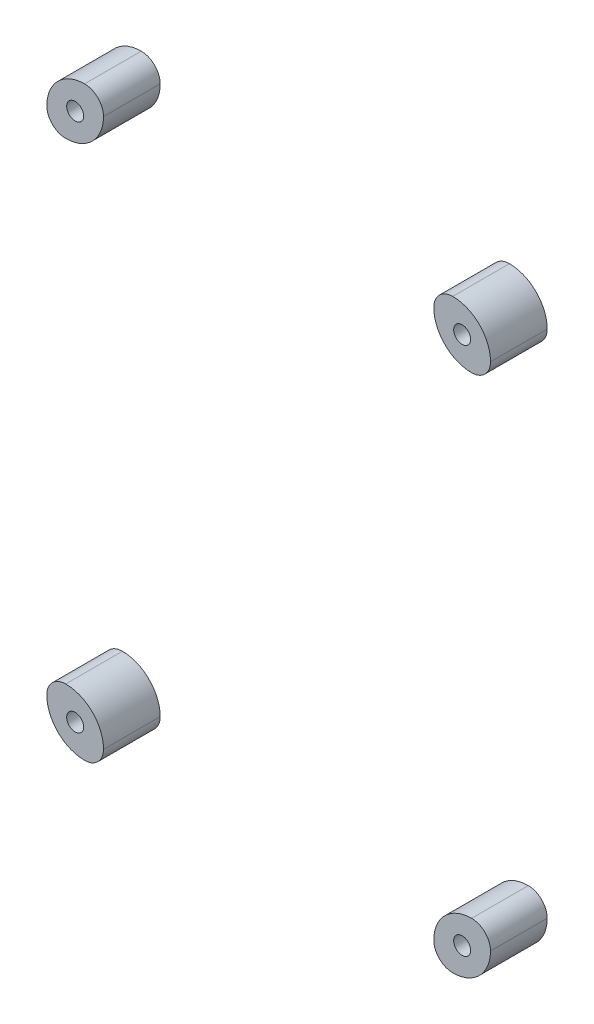
ISO-10303-21;
HEADER;
FILE_DESCRIPTION(('STEP AP214'),'2;1');
FILE_NAME('part.step','',(''),(''),'','','');
FILE_SCHEMA(('AUTOMOTIVE_DESIGN { 1 0 10303 214 1 1 1 1 }'));
ENDSEC;
DATA;
#1=APPLICATION_CONTEXT('core data for automotive mechanical design processes');
#2=APPLICATION_PROTOCOL_DEFINITION('international standard','automotive_design',2000,#1);
#3=PRODUCT_CONTEXT('',#1,'mechanical');
#4=PRODUCT('Part','Part','',(#3));
#5=PRODUCT_RELATED_PRODUCT_CATEGORY('part','',(#4));
#6=PRODUCT_DEFINITION_FORMATION('','',#4);
#7=PRODUCT_DEFINITION_CONTEXT('part definition',#1,'design');
#8=PRODUCT_DEFINITION('design','',#6,#7);
#9=PRODUCT_DEFINITION_SHAPE('','',#8);
#10=(LENGTH_UNIT() NAMED_UNIT(*) SI_UNIT(.MILLI.,.METRE.));
#11=(NAMED_UNIT(*) PLANE_ANGLE_UNIT() SI_UNIT($,.RADIAN.));
#12=(NAMED_UNIT(*) SI_UNIT($,.STERADIAN.) SOLID_ANGLE_UNIT());
#13=UNCERTAINTY_MEASURE_WITH_UNIT(LENGTH_MEASURE(1.E-05),#10,'distance_accuracy_value','');
#14=(GEOMETRIC_REPRESENTATION_CONTEXT(3) GLOBAL_UNCERTAINTY_ASSIGNED_CONTEXT((#13)) GLOBAL_UNIT_ASSIGNED_CONTEXT((#10,
#11,#12)) REPRESENTATION_CONTEXT('',''));
#15=CARTESIAN_POINT('',(0.,0.,0.));
#16=DIRECTION('',(0.,0.,1.));
#17=DIRECTION('',(1.,0.,0.));
#18=AXIS2_PLACEMENT_3D('',#15,#16,#17);
#19=CARTESIAN_POINT('',(-48.6964815263286,-145.,36.2132034355963));
#20=DIRECTION('',(0.,0.,-1.));
#21=DIRECTION('',(1.,0.,0.));
#22=AXIS2_PLACEMENT_3D('',#19,#20,#21);
#23=CYLINDRICAL_SURFACE('',#22,9.99999999999999);
#24=CARTESIAN_POINT('',(-48.6964815263286,-145.,15.));
#25=DIRECTION('',(0.,0.,1.));
#26=DIRECTION('',(-1.,0.,0.));
#27=AXIS2_PLACEMENT_3D('',#24,#25,#26);
#28=CIRCLE('',#27,9.99999999999999);
#29=CARTESIAN_POINT('',(-58.6964815263286,-145.,15.));
#30=VERTEX_POINT('',#29);
#31=CARTESIAN_POINT('',(-48.6964815263286,-155.,15.));
#32=VERTEX_POINT('',#31);
#33=EDGE_CURVE('E111',#30,#32,#28,.T.);
#34=ORIENTED_EDGE('',*,*,#33,.F.);
#35=DIRECTION('',(0.,0.,-1.));
#36=VECTOR('',#35,1.);
#37=CARTESIAN_POINT('',(-58.6964815263286,-145.,36.2132034355963));
#38=LINE('',#37,#36);
#39=CARTESIAN_POINT('',(-58.6964815263286,-145.,0.));
#40=VERTEX_POINT('',#39);
#41=EDGE_CURVE('E54',#30,#40,#38,.T.);
#42=ORIENTED_EDGE('',*,*,#41,.T.);
#43=CARTESIAN_POINT('',(-48.6964815263286,-145.,0.));
#44=DIRECTION('',(0.,0.,1.));
#45=DIRECTION('',(-1.,0.,0.));
#46=AXIS2_PLACEMENT_3D('',#43,#44,#45);
#47=CIRCLE('',#46,9.99999999999999);
#48=CARTESIAN_POINT('',(-48.6964815263286,-155.,0.));
#49=VERTEX_POINT('',#48);
#50=EDGE_CURVE('E106',#40,#49,#47,.T.);
#51=ORIENTED_EDGE('',*,*,#50,.T.);
#52=DIRECTION('',(0.,0.,-1.));
#53=VECTOR('',#52,1.);
#54=CARTESIAN_POINT('',(-48.6964815263286,-155.,36.2132034355963));
#55=LINE('',#54,#53);
#56=EDGE_CURVE('E109',#32,#49,#55,.T.);
#57=ORIENTED_EDGE('',*,*,#56,.F.);
#58=EDGE_LOOP('',(#34,#42,#51,#57));
#59=FACE_BOUND('',#58,.T.);
#60=ADVANCED_FACE('F50',(#59),#23,.T.);
#61=CARTESIAN_POINT('',(-48.6964815263286,-150.,36.2132034355963));
#62=DIRECTION('',(0.,0.,-1.));
#63=DIRECTION('',(1.,0.,0.));
#64=AXIS2_PLACEMENT_3D('',#61,#62,#63);
#65=CYLINDRICAL_SURFACE('',#64,4.99999999999998);
#66=CARTESIAN_POINT('',(-48.6964815263286,-150.,15.));
#67=DIRECTION('',(0.,0.,1.));
#68=DIRECTION('',(-1.,0.,0.));
#69=AXIS2_PLACEMENT_3D('',#66,#67,#68);
#70=CIRCLE('',#69,4.99999999999998);
#71=CARTESIAN_POINT('',(-43.6964815263287,-149.999999999971,15.));
#72=VERTEX_POINT('',#71);
#73=EDGE_CURVE('E59',#32,#72,#70,.T.);
#74=ORIENTED_EDGE('',*,*,#73,.F.);
#75=ORIENTED_EDGE('',*,*,#56,.T.);
#76=CARTESIAN_POINT('',(-48.6964815263286,-150.,0.));
#77=DIRECTION('',(0.,0.,1.));
#78=DIRECTION('',(-1.,0.,0.));
#79=AXIS2_PLACEMENT_3D('',#76,#77,#78);
#80=CIRCLE('',#79,4.99999999999998);
#81=CARTESIAN_POINT('',(-43.6964815263287,-149.999999999971,0.));
#82=VERTEX_POINT('',#81);
#83=EDGE_CURVE('E88',#49,#82,#80,.T.);
#84=ORIENTED_EDGE('',*,*,#83,.T.);
#85=DIRECTION('',(0.,0.,-1.));
#86=VECTOR('',#85,1.);
#87=CARTESIAN_POINT('',(-43.6964815263287,-149.999999999971,36.2132034355963));
#88=LINE('',#87,#86);
#89=EDGE_CURVE('E123',#72,#82,#88,.T.);
#90=ORIENTED_EDGE('',*,*,#89,.F.);
#91=EDGE_LOOP('',(#74,#75,#84,#90));
#92=FACE_BOUND('',#91,.T.);
#93=ADVANCED_FACE('F132',(#92),#65,.T.);
#94=CARTESIAN_POINT('',(-53.6964815263287,-150.,36.2132034355963));
#95=DIRECTION('',(0.,0.,-1.));
#96=DIRECTION('',(1.,0.,0.));
#97=AXIS2_PLACEMENT_3D('',#94,#95,#96);
#98=CYLINDRICAL_SURFACE('',#97,9.99999999999999);
#99=CARTESIAN_POINT('',(-53.6964815263287,-150.,15.));
#100=DIRECTION('',(0.,0.,1.));
#101=DIRECTION('',(-1.,0.,0.));
#102=AXIS2_PLACEMENT_3D('',#99,#100,#101);
#103=CIRCLE('',#102,9.99999999999999);
#104=CARTESIAN_POINT('',(-53.6964815263287,-140.,15.));
#105=VERTEX_POINT('',#104);
#106=EDGE_CURVE('E12',#72,#105,#103,.T.);
#107=ORIENTED_EDGE('',*,*,#106,.F.);
#108=ORIENTED_EDGE('',*,*,#89,.T.);
#109=CARTESIAN_POINT('',(-53.6964815263287,-150.,0.));
#110=DIRECTION('',(0.,0.,1.));
#111=DIRECTION('',(-1.,0.,0.));
#112=AXIS2_PLACEMENT_3D('',#109,#110,#111);
#113=CIRCLE('',#112,9.99999999999999);
#114=CARTESIAN_POINT('',(-53.6964815263287,-140.,0.));
#115=VERTEX_POINT('',#114);
#116=EDGE_CURVE('E121',#82,#115,#113,.T.);
#117=ORIENTED_EDGE('',*,*,#116,.T.);
#118=DIRECTION('',(0.,0.,-1.));
#119=VECTOR('',#118,1.);
#120=CARTESIAN_POINT('',(-53.6964815263287,-140.,36.2132034355963));
#121=LINE('',#120,#119);
#122=EDGE_CURVE('E102',#105,#115,#121,.T.);
#123=ORIENTED_EDGE('',*,*,#122,.F.);
#124=EDGE_LOOP('',(#107,#108,#117,#123));
#125=FACE_BOUND('',#124,.T.);
#126=ADVANCED_FACE('F131',(#125),#98,.T.);
#127=CARTESIAN_POINT('',(-53.6964815263287,-145.,36.2132034355963));
#128=DIRECTION('',(0.,0.,-1.));
#129=DIRECTION('',(1.,0.,0.));
#130=AXIS2_PLACEMENT_3D('',#127,#128,#129);
#131=CYLINDRICAL_SURFACE('',#130,4.99999999999998);
#132=CARTESIAN_POINT('',(-53.6964815263287,-145.,15.));
#133=DIRECTION('',(0.,0.,1.));
#134=DIRECTION('',(-1.,0.,0.));
#135=AXIS2_PLACEMENT_3D('',#132,#133,#134);
#136=CIRCLE('',#135,4.99999999999998);
#137=EDGE_CURVE('E66',#105,#30,#136,.T.);
#138=ORIENTED_EDGE('',*,*,#137,.F.);
#139=ORIENTED_EDGE('',*,*,#122,.T.);
#140=CARTESIAN_POINT('',(-53.6964815263287,-145.,0.));
#141=DIRECTION('',(0.,0.,1.));
#142=DIRECTION('',(-1.,0.,0.));
#143=AXIS2_PLACEMENT_3D('',#140,#141,#142);
#144=CIRCLE('',#143,4.99999999999998);
#145=EDGE_CURVE('E75',#115,#40,#144,.T.);
#146=ORIENTED_EDGE('',*,*,#145,.T.);
#147=ORIENTED_EDGE('',*,*,#41,.F.);
#148=EDGE_LOOP('',(#138,#139,#146,#147));
#149=FACE_BOUND('',#148,.T.);
#150=ADVANCED_FACE('F98',(#149),#131,.T.);
#151=CARTESIAN_POINT('',(-48.6964815263286,-147.5,0.));
#152=DIRECTION('',(0.,0.,1.));
#153=DIRECTION('',(-1.,0.,0.));
#154=AXIS2_PLACEMENT_3D('',#151,#152,#153);
#155=PLANE('',#154);
#156=CARTESIAN_POINT('',(-51.1964815263287,-147.5,0.));
#157=DIRECTION('',(0.,0.,1.));
#158=DIRECTION('',(-1.,0.,0.));
#159=AXIS2_PLACEMENT_3D('',#156,#157,#158);
#160=CIRCLE('',#159,2.25);
#161=CARTESIAN_POINT('',(-53.4464815263287,-147.5,0.));
#162=VERTEX_POINT('',#161);
#163=EDGE_CURVE('E112',#162,#162,#160,.T.);
#164=ORIENTED_EDGE('',*,*,#163,.T.);
#165=EDGE_LOOP('',(#164));
#166=FACE_BOUND('',#165,.T.);
#167=ORIENTED_EDGE('',*,*,#50,.F.);
#168=ORIENTED_EDGE('',*,*,#145,.F.);
#169=ORIENTED_EDGE('',*,*,#116,.F.);
#170=ORIENTED_EDGE('',*,*,#83,.F.);
#171=EDGE_LOOP('',(#167,#168,#169,#170));
#172=FACE_BOUND('',#171,.T.);
#173=ADVANCED_FACE('F107',(#166,#172),#155,.F.);
#174=CARTESIAN_POINT('',(48.6964815263286,-145.,15.));
#175=DIRECTION('',(0.,0.,1.));
#176=DIRECTION('',(-1.,0.,0.));
#177=AXIS2_PLACEMENT_3D('',#174,#175,#176);
#178=PLANE('',#177);
#179=CARTESIAN_POINT('',(-51.1964815263287,-147.5,15.));
#180=DIRECTION('',(0.,0.,1.));
#181=DIRECTION('',(-1.,0.,0.));
#182=AXIS2_PLACEMENT_3D('',#179,#180,#181);
#183=CIRCLE('',#182,2.24999999999999);
#184=CARTESIAN_POINT('',(-53.4464815263286,-147.5,15.));
#185=VERTEX_POINT('',#184);
#186=EDGE_CURVE('E114',#185,#185,#183,.T.);
#187=ORIENTED_EDGE('',*,*,#186,.F.);
#188=EDGE_LOOP('',(#187));
#189=FACE_BOUND('',#188,.T.);
#190=ORIENTED_EDGE('',*,*,#137,.T.);
#191=ORIENTED_EDGE('',*,*,#33,.T.);
#192=ORIENTED_EDGE('',*,*,#73,.T.);
#193=ORIENTED_EDGE('',*,*,#106,.T.);
#194=EDGE_LOOP('',(#190,#191,#192,#193));
#195=FACE_BOUND('',#194,.T.);
#196=ADVANCED_FACE('F52',(#189,#195),#178,.T.);
#197=CARTESIAN_POINT('',(-51.1964815263287,-147.5,15.));
#198=DIRECTION('',(0.,0.,1.));
#199=DIRECTION('',(-1.,0.,0.));
#200=AXIS2_PLACEMENT_3D('',#197,#198,#199);
#201=CYLINDRICAL_SURFACE('',#200,2.24999999999999);
#202=ORIENTED_EDGE('',*,*,#163,.F.);
#203=EDGE_LOOP('',(#202));
#204=FACE_BOUND('',#203,.T.);
#205=ORIENTED_EDGE('',*,*,#186,.T.);
#206=EDGE_LOOP('',(#205));
#207=FACE_BOUND('',#206,.T.);
#208=ADVANCED_FACE('F134',(#204,#207),#201,.F.);
#209=CLOSED_SHELL('',(#60,#93,#126,#150,#173,#196,#208));
#210=MANIFOLD_SOLID_BREP('B2',#209);
#211=CARTESIAN_POINT('',(-48.6964815263286,-9.99999999999999,36.2132034355963));
#212=DIRECTION('',(0.,0.,-1.));
#213=DIRECTION('',(1.,0.,0.));
#214=AXIS2_PLACEMENT_3D('',#211,#212,#213);
#215=CYLINDRICAL_SURFACE('',#214,9.99999999999999);
#216=CARTESIAN_POINT('',(-48.6964815263286,-9.99999999999999,15.));
#217=DIRECTION('',(0.,0.,-1.));
#218=DIRECTION('',(-1.,0.,0.));
#219=AXIS2_PLACEMENT_3D('',#216,#217,#218);
#220=CIRCLE('',#219,9.99999999999999);
#221=CARTESIAN_POINT('',(-58.6964815263286,-9.99999999999992,15.));
#222=VERTEX_POINT('',#221);
#223=CARTESIAN_POINT('',(-48.6964815263286,0.,15.));
#224=VERTEX_POINT('',#223);
#225=EDGE_CURVE('E287',#222,#224,#220,.T.);
#226=ORIENTED_EDGE('',*,*,#225,.T.);
#227=DIRECTION('',(0.,0.,-1.));
#228=VECTOR('',#227,1.);
#229=CARTESIAN_POINT('',(-48.6964815263286,0.,36.2132034355963));
#230=LINE('',#229,#228);
#231=CARTESIAN_POINT('',(-48.6964815263286,0.,0.));
#232=VERTEX_POINT('',#231);
#233=EDGE_CURVE('E280',#224,#232,#230,.T.);
#234=ORIENTED_EDGE('',*,*,#233,.T.);
#235=CARTESIAN_POINT('',(-48.6964815263286,-9.99999999999999,0.));
#236=DIRECTION('',(0.,0.,-1.));
#237=DIRECTION('',(-1.,0.,0.));
#238=AXIS2_PLACEMENT_3D('',#235,#236,#237);
#239=CIRCLE('',#238,9.99999999999999);
#240=CARTESIAN_POINT('',(-58.6964815263286,-9.99999999999992,0.));
#241=VERTEX_POINT('',#240);
#242=EDGE_CURVE('E270',#241,#232,#239,.T.);
#243=ORIENTED_EDGE('',*,*,#242,.F.);
#244=DIRECTION('',(0.,0.,-1.));
#245=VECTOR('',#244,1.);
#246=CARTESIAN_POINT('',(-58.6964815263286,-9.99999999999992,36.2132034355963));
#247=LINE('',#246,#245);
#248=EDGE_CURVE('E223',#222,#241,#247,.T.);
#249=ORIENTED_EDGE('',*,*,#248,.F.);
#250=EDGE_LOOP('',(#226,#234,#243,#249));
#251=FACE_BOUND('',#250,.T.);
#252=ADVANCED_FACE('F219',(#251),#215,.T.);
#253=CARTESIAN_POINT('',(-48.6964815263286,-4.99999999999999,36.2132034355963));
#254=DIRECTION('',(0.,0.,-1.));
#255=DIRECTION('',(1.,0.,0.));
#256=AXIS2_PLACEMENT_3D('',#253,#254,#255);
#257=CYLINDRICAL_SURFACE('',#256,4.99999999999998);
#258=CARTESIAN_POINT('',(-48.6964815263286,-4.99999999999999,15.));
#259=DIRECTION('',(0.,0.,-1.));
#260=DIRECTION('',(-1.,0.,0.));
#261=AXIS2_PLACEMENT_3D('',#258,#259,#260);
#262=CIRCLE('',#261,4.99999999999998);
#263=CARTESIAN_POINT('',(-43.6964815263287,-5.00000000002915,15.));
#264=VERTEX_POINT('',#263);
#265=EDGE_CURVE('E228',#224,#264,#262,.T.);
#266=ORIENTED_EDGE('',*,*,#265,.T.);
#267=DIRECTION('',(0.,0.,-1.));
#268=VECTOR('',#267,1.);
#269=CARTESIAN_POINT('',(-43.6964815263287,-5.00000000002915,36.2132034355963));
#270=LINE('',#269,#268);
#271=CARTESIAN_POINT('',(-43.6964815263287,-5.00000000002915,0.));
#272=VERTEX_POINT('',#271);
#273=EDGE_CURVE('E290',#264,#272,#270,.T.);
#274=ORIENTED_EDGE('',*,*,#273,.T.);
#275=CARTESIAN_POINT('',(-48.6964815263286,-4.99999999999999,0.));
#276=DIRECTION('',(0.,0.,-1.));
#277=DIRECTION('',(-1.,0.,0.));
#278=AXIS2_PLACEMENT_3D('',#275,#276,#277);
#279=CIRCLE('',#278,4.99999999999998);
#280=EDGE_CURVE('E259',#232,#272,#279,.T.);
#281=ORIENTED_EDGE('',*,*,#280,.F.);
#282=ORIENTED_EDGE('',*,*,#233,.F.);
#283=EDGE_LOOP('',(#266,#274,#281,#282));
#284=FACE_BOUND('',#283,.T.);
#285=ADVANCED_FACE('F309',(#284),#257,.T.);
#286=CARTESIAN_POINT('',(-53.6964815263287,-4.99999999999991,36.2132034355963));
#287=DIRECTION('',(0.,0.,-1.));
#288=DIRECTION('',(1.,0.,0.));
#289=AXIS2_PLACEMENT_3D('',#286,#287,#288);
#290=CYLINDRICAL_SURFACE('',#289,9.99999999999999);
#291=CARTESIAN_POINT('',(-53.6964815263287,-4.99999999999991,15.));
#292=DIRECTION('',(0.,0.,-1.));
#293=DIRECTION('',(-1.,0.,0.));
#294=AXIS2_PLACEMENT_3D('',#291,#292,#293);
#295=CIRCLE('',#294,9.99999999999999);
#296=CARTESIAN_POINT('',(-53.6964815263287,-14.9999999999999,15.));
#297=VERTEX_POINT('',#296);
#298=EDGE_CURVE('E48',#264,#297,#295,.T.);
#299=ORIENTED_EDGE('',*,*,#298,.T.);
#300=DIRECTION('',(0.,0.,-1.));
#301=VECTOR('',#300,1.);
#302=CARTESIAN_POINT('',(-53.6964815263287,-14.9999999999999,36.2132034355963));
#303=LINE('',#302,#301);
#304=CARTESIAN_POINT('',(-53.6964815263287,-14.9999999999999,0.));
#305=VERTEX_POINT('',#304);
#306=EDGE_CURVE('E274',#297,#305,#303,.T.);
#307=ORIENTED_EDGE('',*,*,#306,.T.);
#308=CARTESIAN_POINT('',(-53.6964815263287,-4.99999999999991,0.));
#309=DIRECTION('',(0.,0.,-1.));
#310=DIRECTION('',(-1.,0.,0.));
#311=AXIS2_PLACEMENT_3D('',#308,#309,#310);
#312=CIRCLE('',#311,9.99999999999999);
#313=EDGE_CURVE('E272',#272,#305,#312,.T.);
#314=ORIENTED_EDGE('',*,*,#313,.F.);
#315=ORIENTED_EDGE('',*,*,#273,.F.);
#316=EDGE_LOOP('',(#299,#307,#314,#315));
#317=FACE_BOUND('',#316,.T.);
#318=ADVANCED_FACE('F313',(#317),#290,.T.);
#319=CARTESIAN_POINT('',(-53.6964815263287,-9.99999999999993,36.2132034355963));
#320=DIRECTION('',(0.,0.,-1.));
#321=DIRECTION('',(1.,0.,0.));
#322=AXIS2_PLACEMENT_3D('',#319,#320,#321);
#323=CYLINDRICAL_SURFACE('',#322,4.99999999999998);
#324=CARTESIAN_POINT('',(-53.6964815263287,-9.99999999999993,15.));
#325=DIRECTION('',(0.,0.,-1.));
#326=DIRECTION('',(-1.,0.,0.));
#327=AXIS2_PLACEMENT_3D('',#324,#325,#326);
#328=CIRCLE('',#327,4.99999999999998);
#329=EDGE_CURVE('E236',#297,#222,#328,.T.);
#330=ORIENTED_EDGE('',*,*,#329,.T.);
#331=ORIENTED_EDGE('',*,*,#248,.T.);
#332=CARTESIAN_POINT('',(-53.6964815263287,-9.99999999999993,0.));
#333=DIRECTION('',(0.,0.,-1.));
#334=DIRECTION('',(-1.,0.,0.));
#335=AXIS2_PLACEMENT_3D('',#332,#333,#334);
#336=CIRCLE('',#335,4.99999999999998);
#337=EDGE_CURVE('E242',#305,#241,#336,.T.);
#338=ORIENTED_EDGE('',*,*,#337,.F.);
#339=ORIENTED_EDGE('',*,*,#306,.F.);
#340=EDGE_LOOP('',(#330,#331,#338,#339));
#341=FACE_BOUND('',#340,.T.);
#342=ADVANCED_FACE('F276',(#341),#323,.T.);
#343=CARTESIAN_POINT('',(-48.6964815263286,-7.49999999999999,0.));
#344=DIRECTION('',(0.,0.,1.));
#345=DIRECTION('',(-1.,0.,0.));
#346=AXIS2_PLACEMENT_3D('',#343,#344,#345);
#347=PLANE('',#346);
#348=CARTESIAN_POINT('',(-51.1964815263287,-7.49999999999995,0.));
#349=DIRECTION('',(0.,0.,-1.));
#350=DIRECTION('',(-1.,0.,0.));
#351=AXIS2_PLACEMENT_3D('',#348,#349,#350);
#352=CIRCLE('',#351,2.25);
#353=CARTESIAN_POINT('',(-53.4464815263287,-7.49999999999995,0.));
#354=VERTEX_POINT('',#353);
#355=EDGE_CURVE('E279',#354,#354,#352,.T.);
#356=ORIENTED_EDGE('',*,*,#355,.F.);
#357=EDGE_LOOP('',(#356));
#358=FACE_BOUND('',#357,.T.);
#359=ORIENTED_EDGE('',*,*,#242,.T.);
#360=ORIENTED_EDGE('',*,*,#280,.T.);
#361=ORIENTED_EDGE('',*,*,#313,.T.);
#362=ORIENTED_EDGE('',*,*,#337,.T.);
#363=EDGE_LOOP('',(#359,#360,#361,#362));
#364=FACE_BOUND('',#363,.T.);
#365=ADVANCED_FACE('F268',(#358,#364),#347,.F.);
#366=CARTESIAN_POINT('',(48.6964815263286,-10.,15.));
#367=DIRECTION('',(0.,0.,1.));
#368=DIRECTION('',(-1.,0.,0.));
#369=AXIS2_PLACEMENT_3D('',#366,#367,#368);
#370=PLANE('',#369);
#371=CARTESIAN_POINT('',(-51.1964815263287,-7.49999999999995,15.));
#372=DIRECTION('',(0.,0.,-1.));
#373=DIRECTION('',(-1.,0.,0.));
#374=AXIS2_PLACEMENT_3D('',#371,#372,#373);
#375=CIRCLE('',#374,2.24999999999999);
#376=CARTESIAN_POINT('',(-53.4464815263286,-7.49999999999995,15.));
#377=VERTEX_POINT('',#376);
#378=EDGE_CURVE('E295',#377,#377,#375,.T.);
#379=ORIENTED_EDGE('',*,*,#378,.T.);
#380=EDGE_LOOP('',(#379));
#381=FACE_BOUND('',#380,.T.);
#382=ORIENTED_EDGE('',*,*,#329,.F.);
#383=ORIENTED_EDGE('',*,*,#298,.F.);
#384=ORIENTED_EDGE('',*,*,#265,.F.);
#385=ORIENTED_EDGE('',*,*,#225,.F.);
#386=EDGE_LOOP('',(#382,#383,#384,#385));
#387=FACE_BOUND('',#386,.T.);
#388=ADVANCED_FACE('F221',(#381,#387),#370,.T.);
#389=CARTESIAN_POINT('',(-51.1964815263287,-7.49999999999995,15.));
#390=DIRECTION('',(0.,0.,1.));
#391=DIRECTION('',(-1.,0.,0.));
#392=AXIS2_PLACEMENT_3D('',#389,#390,#391);
#393=CYLINDRICAL_SURFACE('',#392,2.24999999999999);
#394=ORIENTED_EDGE('',*,*,#355,.T.);
#395=EDGE_LOOP('',(#394));
#396=FACE_BOUND('',#395,.T.);
#397=ORIENTED_EDGE('',*,*,#378,.F.);
#398=EDGE_LOOP('',(#397));
#399=FACE_BOUND('',#398,.T.);
#400=ADVANCED_FACE('F300',(#396,#399),#393,.F.);
#401=CLOSED_SHELL('',(#252,#285,#318,#342,#365,#388,#400));
#402=MANIFOLD_SOLID_BREP('B6',#401);
#403=CARTESIAN_POINT('',(48.6964815263286,-145.,36.2132034355963));
#404=DIRECTION('',(0.,0.,-1.));
#405=DIRECTION('',(-1.,0.,0.));
#406=AXIS2_PLACEMENT_3D('',#403,#404,#405);
#407=CYLINDRICAL_SURFACE('',#406,9.99999999999999);
#408=CARTESIAN_POINT('',(48.6964815263286,-145.,15.));
#409=DIRECTION('',(0.,0.,-1.));
#410=DIRECTION('',(1.,0.,0.));
#411=AXIS2_PLACEMENT_3D('',#408,#409,#410);
#412=CIRCLE('',#411,9.99999999999999);
#413=CARTESIAN_POINT('',(58.6964815263286,-145.,15.));
#414=VERTEX_POINT('',#413);
#415=CARTESIAN_POINT('',(48.6964815263286,-155.,15.));
#416=VERTEX_POINT('',#415);
#417=EDGE_CURVE('E455',#414,#416,#412,.T.);
#418=ORIENTED_EDGE('',*,*,#417,.T.);
#419=DIRECTION('',(0.,0.,-1.));
#420=VECTOR('',#419,1.);
#421=CARTESIAN_POINT('',(48.6964815263286,-155.,36.2132034355963));
#422=LINE('',#421,#420);
#423=CARTESIAN_POINT('',(48.6964815263286,-155.,0.));
#424=VERTEX_POINT('',#423);
#425=EDGE_CURVE('E448',#416,#424,#422,.T.);
#426=ORIENTED_EDGE('',*,*,#425,.T.);
#427=CARTESIAN_POINT('',(48.6964815263286,-145.,0.));
#428=DIRECTION('',(0.,0.,-1.));
#429=DIRECTION('',(1.,0.,0.));
#430=AXIS2_PLACEMENT_3D('',#427,#428,#429);
#431=CIRCLE('',#430,9.99999999999999);
#432=CARTESIAN_POINT('',(58.6964815263286,-145.,0.));
#433=VERTEX_POINT('',#432);
#434=EDGE_CURVE('E438',#433,#424,#431,.T.);
#435=ORIENTED_EDGE('',*,*,#434,.F.);
#436=DIRECTION('',(0.,0.,-1.));
#437=VECTOR('',#436,1.);
#438=CARTESIAN_POINT('',(58.6964815263286,-145.,36.2132034355963));
#439=LINE('',#438,#437);
#440=EDGE_CURVE('E391',#414,#433,#439,.T.);
#441=ORIENTED_EDGE('',*,*,#440,.F.);
#442=EDGE_LOOP('',(#418,#426,#435,#441));
#443=FACE_BOUND('',#442,.T.);
#444=ADVANCED_FACE('F387',(#443),#407,.T.);
#445=CARTESIAN_POINT('',(48.6964815263286,-150.,36.2132034355963));
#446=DIRECTION('',(0.,0.,-1.));
#447=DIRECTION('',(-1.,0.,0.));
#448=AXIS2_PLACEMENT_3D('',#445,#446,#447);
#449=CYLINDRICAL_SURFACE('',#448,4.99999999999998);
#450=CARTESIAN_POINT('',(48.6964815263286,-150.,15.));
#451=DIRECTION('',(0.,0.,-1.));
#452=DIRECTION('',(1.,0.,0.));
#453=AXIS2_PLACEMENT_3D('',#450,#451,#452);
#454=CIRCLE('',#453,4.99999999999998);
#455=CARTESIAN_POINT('',(43.6964815263287,-149.999999999971,15.));
#456=VERTEX_POINT('',#455);
#457=EDGE_CURVE('E396',#416,#456,#454,.T.);
#458=ORIENTED_EDGE('',*,*,#457,.T.);
#459=DIRECTION('',(0.,0.,-1.));
#460=VECTOR('',#459,1.);
#461=CARTESIAN_POINT('',(43.6964815263287,-149.999999999971,36.2132034355963));
#462=LINE('',#461,#460);
#463=CARTESIAN_POINT('',(43.6964815263287,-149.999999999971,0.));
#464=VERTEX_POINT('',#463);
#465=EDGE_CURVE('E458',#456,#464,#462,.T.);
#466=ORIENTED_EDGE('',*,*,#465,.T.);
#467=CARTESIAN_POINT('',(48.6964815263286,-150.,0.));
#468=DIRECTION('',(0.,0.,-1.));
#469=DIRECTION('',(1.,0.,0.));
#470=AXIS2_PLACEMENT_3D('',#467,#468,#469);
#471=CIRCLE('',#470,4.99999999999998);
#472=EDGE_CURVE('E427',#424,#464,#471,.T.);
#473=ORIENTED_EDGE('',*,*,#472,.F.);
#474=ORIENTED_EDGE('',*,*,#425,.F.);
#475=EDGE_LOOP('',(#458,#466,#473,#474));
#476=FACE_BOUND('',#475,.T.);
#477=ADVANCED_FACE('F477',(#476),#449,.T.);
#478=CARTESIAN_POINT('',(53.6964815263287,-150.,36.2132034355963));
#479=DIRECTION('',(0.,0.,-1.));
#480=DIRECTION('',(-1.,0.,0.));
#481=AXIS2_PLACEMENT_3D('',#478,#479,#480);
#482=CYLINDRICAL_SURFACE('',#481,9.99999999999999);
#483=CARTESIAN_POINT('',(53.6964815263287,-150.,15.));
#484=DIRECTION('',(0.,0.,-1.));
#485=DIRECTION('',(1.,0.,0.));
#486=AXIS2_PLACEMENT_3D('',#483,#484,#485);
#487=CIRCLE('',#486,9.99999999999999);
#488=CARTESIAN_POINT('',(53.6964815263287,-140.,15.));
#489=VERTEX_POINT('',#488);
#490=EDGE_CURVE('E217',#456,#489,#487,.T.);
#491=ORIENTED_EDGE('',*,*,#490,.T.);
#492=DIRECTION('',(0.,0.,-1.));
#493=VECTOR('',#492,1.);
#494=CARTESIAN_POINT('',(53.6964815263287,-140.,36.2132034355963));
#495=LINE('',#494,#493);
#496=CARTESIAN_POINT('',(53.6964815263287,-140.,0.));
#497=VERTEX_POINT('',#496);
#498=EDGE_CURVE('E442',#489,#497,#495,.T.);
#499=ORIENTED_EDGE('',*,*,#498,.T.);
#500=CARTESIAN_POINT('',(53.6964815263287,-150.,0.));
#501=DIRECTION('',(0.,0.,-1.));
#502=DIRECTION('',(1.,0.,0.));
#503=AXIS2_PLACEMENT_3D('',#500,#501,#502);
#504=CIRCLE('',#503,9.99999999999999);
#505=EDGE_CURVE('E440',#464,#497,#504,.T.);
#506=ORIENTED_EDGE('',*,*,#505,.F.);
#507=ORIENTED_EDGE('',*,*,#465,.F.);
#508=EDGE_LOOP('',(#491,#499,#506,#507));
#509=FACE_BOUND('',#508,.T.);
#510=ADVANCED_FACE('F481',(#509),#482,.T.);
#511=CARTESIAN_POINT('',(53.6964815263287,-145.,36.2132034355963));
#512=DIRECTION('',(0.,0.,-1.));
#513=DIRECTION('',(-1.,0.,0.));
#514=AXIS2_PLACEMENT_3D('',#511,#512,#513);
#515=CYLINDRICAL_SURFACE('',#514,4.99999999999998);
#516=CARTESIAN_POINT('',(53.6964815263287,-145.,15.));
#517=DIRECTION('',(0.,0.,-1.));
#518=DIRECTION('',(1.,0.,0.));
#519=AXIS2_PLACEMENT_3D('',#516,#517,#518);
#520=CIRCLE('',#519,4.99999999999998);
#521=EDGE_CURVE('E404',#489,#414,#520,.T.);
#522=ORIENTED_EDGE('',*,*,#521,.T.);
#523=ORIENTED_EDGE('',*,*,#440,.T.);
#524=CARTESIAN_POINT('',(53.6964815263287,-145.,0.));
#525=DIRECTION('',(0.,0.,-1.));
#526=DIRECTION('',(1.,0.,0.));
#527=AXIS2_PLACEMENT_3D('',#524,#525,#526);
#528=CIRCLE('',#527,4.99999999999998);
#529=EDGE_CURVE('E410',#497,#433,#528,.T.);
#530=ORIENTED_EDGE('',*,*,#529,.F.);
#531=ORIENTED_EDGE('',*,*,#498,.F.);
#532=EDGE_LOOP('',(#522,#523,#530,#531));
#533=FACE_BOUND('',#532,.T.);
#534=ADVANCED_FACE('F444',(#533),#515,.T.);
#535=CARTESIAN_POINT('',(48.6964815263286,-147.5,0.));
#536=DIRECTION('',(0.,0.,1.));
#537=DIRECTION('',(1.,0.,0.));
#538=AXIS2_PLACEMENT_3D('',#535,#536,#537);
#539=PLANE('',#538);
#540=CARTESIAN_POINT('',(51.1964815263287,-147.5,0.));
#541=DIRECTION('',(0.,0.,-1.));
#542=DIRECTION('',(1.,0.,0.));
#543=AXIS2_PLACEMENT_3D('',#540,#541,#542);
#544=CIRCLE('',#543,2.25);
#545=CARTESIAN_POINT('',(53.4464815263287,-147.5,0.));
#546=VERTEX_POINT('',#545);
#547=EDGE_CURVE('E447',#546,#546,#544,.T.);
#548=ORIENTED_EDGE('',*,*,#547,.F.);
#549=EDGE_LOOP('',(#548));
#550=FACE_BOUND('',#549,.T.);
#551=ORIENTED_EDGE('',*,*,#434,.T.);
#552=ORIENTED_EDGE('',*,*,#472,.T.);
#553=ORIENTED_EDGE('',*,*,#505,.T.);
#554=ORIENTED_EDGE('',*,*,#529,.T.);
#555=EDGE_LOOP('',(#551,#552,#553,#554));
#556=FACE_BOUND('',#555,.T.);
#557=ADVANCED_FACE('F436',(#550,#556),#539,.F.);
#558=CARTESIAN_POINT('',(-48.6964815263286,-145.,15.));
#559=DIRECTION('',(0.,0.,1.));
#560=DIRECTION('',(1.,0.,0.));
#561=AXIS2_PLACEMENT_3D('',#558,#559,#560);
#562=PLANE('',#561);
#563=CARTESIAN_POINT('',(51.1964815263287,-147.5,15.));
#564=DIRECTION('',(0.,0.,-1.));
#565=DIRECTION('',(1.,0.,0.));
#566=AXIS2_PLACEMENT_3D('',#563,#564,#565);
#567=CIRCLE('',#566,2.24999999999999);
#568=CARTESIAN_POINT('',(53.4464815263286,-147.5,15.));
#569=VERTEX_POINT('',#568);
#570=EDGE_CURVE('E463',#569,#569,#567,.T.);
#571=ORIENTED_EDGE('',*,*,#570,.T.);
#572=EDGE_LOOP('',(#571));
#573=FACE_BOUND('',#572,.T.);
#574=ORIENTED_EDGE('',*,*,#521,.F.);
#575=ORIENTED_EDGE('',*,*,#490,.F.);
#576=ORIENTED_EDGE('',*,*,#457,.F.);
#577=ORIENTED_EDGE('',*,*,#417,.F.);
#578=EDGE_LOOP('',(#574,#575,#576,#577));
#579=FACE_BOUND('',#578,.T.);
#580=ADVANCED_FACE('F389',(#573,#579),#562,.T.);
#581=CARTESIAN_POINT('',(51.1964815263287,-147.5,15.));
#582=DIRECTION('',(0.,0.,1.));
#583=DIRECTION('',(1.,0.,0.));
#584=AXIS2_PLACEMENT_3D('',#581,#582,#583);
#585=CYLINDRICAL_SURFACE('',#584,2.24999999999999);
#586=ORIENTED_EDGE('',*,*,#547,.T.);
#587=EDGE_LOOP('',(#586));
#588=FACE_BOUND('',#587,.T.);
#589=ORIENTED_EDGE('',*,*,#570,.F.);
#590=EDGE_LOOP('',(#589));
#591=FACE_BOUND('',#590,.T.);
#592=ADVANCED_FACE('F468',(#588,#591),#585,.F.);
#593=CLOSED_SHELL('',(#444,#477,#510,#534,#557,#580,#592));
#594=MANIFOLD_SOLID_BREP('B42',#593);
#595=CARTESIAN_POINT('',(48.6964815263286,-10.,36.2132034355963));
#596=DIRECTION('',(0.,0.,-1.));
#597=DIRECTION('',(-1.,0.,0.));
#598=AXIS2_PLACEMENT_3D('',#595,#596,#597);
#599=CYLINDRICAL_SURFACE('',#598,9.99999999999999);
#600=CARTESIAN_POINT('',(48.6964815263286,-10.,15.));
#601=DIRECTION('',(0.,0.,1.));
#602=DIRECTION('',(1.,0.,0.));
#603=AXIS2_PLACEMENT_3D('',#600,#601,#602);
#604=CIRCLE('',#603,9.99999999999999);
#605=CARTESIAN_POINT('',(58.6964815263286,-9.99999999999993,15.));
#606=VERTEX_POINT('',#605);
#607=CARTESIAN_POINT('',(48.6964815263286,0.,15.));
#608=VERTEX_POINT('',#607);
#609=EDGE_CURVE('E596',#606,#608,#604,.T.);
#610=ORIENTED_EDGE('',*,*,#609,.F.);
#611=DIRECTION('',(0.,0.,-1.));
#612=VECTOR('',#611,1.);
#613=CARTESIAN_POINT('',(58.6964815263286,-9.99999999999993,36.2132034355963));
#614=LINE('',#613,#612);
#615=CARTESIAN_POINT('',(58.6964815263286,-9.99999999999993,0.));
#616=VERTEX_POINT('',#615);
#617=EDGE_CURVE('E550',#606,#616,#614,.T.);
#618=ORIENTED_EDGE('',*,*,#617,.T.);
#619=CARTESIAN_POINT('',(48.6964815263286,-10.,0.));
#620=DIRECTION('',(0.,0.,1.));
#621=DIRECTION('',(1.,0.,0.));
#622=AXIS2_PLACEMENT_3D('',#619,#620,#621);
#623=CIRCLE('',#622,9.99999999999999);
#624=CARTESIAN_POINT('',(48.6964815263286,0.,0.));
#625=VERTEX_POINT('',#624);
#626=EDGE_CURVE('E594',#616,#625,#623,.T.);
#627=ORIENTED_EDGE('',*,*,#626,.T.);
#628=DIRECTION('',(0.,0.,-1.));
#629=VECTOR('',#628,1.);
#630=CARTESIAN_POINT('',(48.6964815263286,0.,36.2132034355963));
#631=LINE('',#630,#629);
#632=EDGE_CURVE('E585',#608,#625,#631,.T.);
#633=ORIENTED_EDGE('',*,*,#632,.F.);
#634=EDGE_LOOP('',(#610,#618,#627,#633));
#635=FACE_BOUND('',#634,.T.);
#636=ADVANCED_FACE('F546',(#635),#599,.T.);
#637=CARTESIAN_POINT('',(48.6964815263286,-4.99999999999999,36.2132034355963));
#638=DIRECTION('',(0.,0.,-1.));
#639=DIRECTION('',(-1.,0.,0.));
#640=AXIS2_PLACEMENT_3D('',#637,#638,#639);
#641=CYLINDRICAL_SURFACE('',#640,4.99999999999998);
#642=CARTESIAN_POINT('',(48.6964815263286,-4.99999999999999,15.));
#643=DIRECTION('',(0.,0.,1.));
#644=DIRECTION('',(1.,0.,0.));
#645=AXIS2_PLACEMENT_3D('',#642,#643,#644);
#646=CIRCLE('',#645,4.99999999999998);
#647=CARTESIAN_POINT('',(43.6964815263287,-5.00000000002915,15.));
#648=VERTEX_POINT('',#647);
#649=EDGE_CURVE('E555',#608,#648,#646,.T.);
#650=ORIENTED_EDGE('',*,*,#649,.F.);
#651=ORIENTED_EDGE('',*,*,#632,.T.);
#652=CARTESIAN_POINT('',(48.6964815263286,-4.99999999999999,0.));
#653=DIRECTION('',(0.,0.,1.));
#654=DIRECTION('',(1.,0.,0.));
#655=AXIS2_PLACEMENT_3D('',#652,#653,#654);
#656=CIRCLE('',#655,4.99999999999998);
#657=CARTESIAN_POINT('',(43.6964815263287,-5.00000000002915,0.));
#658=VERTEX_POINT('',#657);
#659=EDGE_CURVE('E607',#625,#658,#656,.T.);
#660=ORIENTED_EDGE('',*,*,#659,.T.);
#661=DIRECTION('',(0.,0.,-1.));
#662=VECTOR('',#661,1.);
#663=CARTESIAN_POINT('',(43.6964815263287,-5.00000000002915,36.2132034355963));
#664=LINE('',#663,#662);
#665=EDGE_CURVE('E616',#648,#658,#664,.T.);
#666=ORIENTED_EDGE('',*,*,#665,.F.);
#667=EDGE_LOOP('',(#650,#651,#660,#666));
#668=FACE_BOUND('',#667,.T.);
#669=ADVANCED_FACE('F631',(#668),#641,.T.);
#670=CARTESIAN_POINT('',(53.6964815263287,-4.99999999999991,36.2132034355963));
#671=DIRECTION('',(0.,0.,-1.));
#672=DIRECTION('',(-1.,0.,0.));
#673=AXIS2_PLACEMENT_3D('',#670,#671,#672);
#674=CYLINDRICAL_SURFACE('',#673,9.99999999999999);
#675=CARTESIAN_POINT('',(53.6964815263287,-4.99999999999991,15.));
#676=DIRECTION('',(0.,0.,1.));
#677=DIRECTION('',(1.,0.,0.));
#678=AXIS2_PLACEMENT_3D('',#675,#676,#677);
#679=CIRCLE('',#678,9.99999999999999);
#680=CARTESIAN_POINT('',(53.6964815263287,-14.9999999999999,15.));
#681=VERTEX_POINT('',#680);
#682=EDGE_CURVE('E385',#648,#681,#679,.T.);
#683=ORIENTED_EDGE('',*,*,#682,.F.);
#684=ORIENTED_EDGE('',*,*,#665,.T.);
#685=CARTESIAN_POINT('',(53.6964815263287,-4.99999999999991,0.));
#686=DIRECTION('',(0.,0.,1.));
#687=DIRECTION('',(1.,0.,0.));
#688=AXIS2_PLACEMENT_3D('',#685,#686,#687);
#689=CIRCLE('',#688,9.99999999999999);
#690=CARTESIAN_POINT('',(53.6964815263287,-14.9999999999999,0.));
#691=VERTEX_POINT('',#690);
#692=EDGE_CURVE('E617',#658,#691,#689,.T.);
#693=ORIENTED_EDGE('',*,*,#692,.T.);
#694=DIRECTION('',(0.,0.,-1.));
#695=VECTOR('',#694,1.);
#696=CARTESIAN_POINT('',(53.6964815263287,-14.9999999999999,36.2132034355963));
#697=LINE('',#696,#695);
#698=EDGE_CURVE('E568',#681,#691,#697,.T.);
#699=ORIENTED_EDGE('',*,*,#698,.F.);
#700=EDGE_LOOP('',(#683,#684,#693,#699));
#701=FACE_BOUND('',#700,.T.);
#702=ADVANCED_FACE('F630',(#701),#674,.T.);
#703=CARTESIAN_POINT('',(53.6964815263287,-9.99999999999993,36.2132034355963));
#704=DIRECTION('',(0.,0.,-1.));
#705=DIRECTION('',(-1.,0.,0.));
#706=AXIS2_PLACEMENT_3D('',#703,#704,#705);
#707=CYLINDRICAL_SURFACE('',#706,4.99999999999998);
#708=CARTESIAN_POINT('',(53.6964815263287,-9.99999999999993,15.));
#709=DIRECTION('',(0.,0.,1.));
#710=DIRECTION('',(1.,0.,0.));
#711=AXIS2_PLACEMENT_3D('',#708,#709,#710);
#712=CIRCLE('',#711,4.99999999999998);
#713=EDGE_CURVE('E604',#681,#606,#712,.T.);
#714=ORIENTED_EDGE('',*,*,#713,.F.);
#715=ORIENTED_EDGE('',*,*,#698,.T.);
#716=CARTESIAN_POINT('',(53.6964815263287,-9.99999999999993,0.));
#717=DIRECTION('',(0.,0.,1.));
#718=DIRECTION('',(1.,0.,0.));
#719=AXIS2_PLACEMENT_3D('',#716,#717,#718);
#720=CIRCLE('',#719,4.99999999999998);
#721=EDGE_CURVE('E600',#691,#616,#720,.T.);
#722=ORIENTED_EDGE('',*,*,#721,.T.);
#723=ORIENTED_EDGE('',*,*,#617,.F.);
#724=EDGE_LOOP('',(#714,#715,#722,#723));
#725=FACE_BOUND('',#724,.T.);
#726=ADVANCED_FACE('F601',(#725),#707,.T.);
#727=CARTESIAN_POINT('',(48.6964815263286,-7.5,0.));
#728=DIRECTION('',(0.,0.,1.));
#729=DIRECTION('',(1.,0.,0.));
#730=AXIS2_PLACEMENT_3D('',#727,#728,#729);
#731=PLANE('',#730);
#732=CARTESIAN_POINT('',(51.1964815263287,-7.49999999999996,0.));
#733=DIRECTION('',(0.,0.,1.));
#734=DIRECTION('',(1.,0.,0.));
#735=AXIS2_PLACEMENT_3D('',#732,#733,#734);
#736=CIRCLE('',#735,2.25);
#737=CARTESIAN_POINT('',(53.4464815263287,-7.49999999999996,0.));
#738=VERTEX_POINT('',#737);
#739=EDGE_CURVE('E598',#738,#738,#736,.T.);
#740=ORIENTED_EDGE('',*,*,#739,.T.);
#741=EDGE_LOOP('',(#740));
#742=FACE_BOUND('',#741,.T.);
#743=ORIENTED_EDGE('',*,*,#626,.F.);
#744=ORIENTED_EDGE('',*,*,#721,.F.);
#745=ORIENTED_EDGE('',*,*,#692,.F.);
#746=ORIENTED_EDGE('',*,*,#659,.F.);
#747=EDGE_LOOP('',(#743,#744,#745,#746));
#748=FACE_BOUND('',#747,.T.);
#749=ADVANCED_FACE('F606',(#742,#748),#731,.F.);
#750=CARTESIAN_POINT('',(-48.6964815263286,-10.,15.));
#751=DIRECTION('',(0.,0.,1.));
#752=DIRECTION('',(1.,0.,0.));
#753=AXIS2_PLACEMENT_3D('',#750,#751,#752);
#754=PLANE('',#753);
#755=CARTESIAN_POINT('',(51.1964815263287,-7.49999999999996,15.));
#756=DIRECTION('',(0.,0.,1.));
#757=DIRECTION('',(1.,0.,0.));
#758=AXIS2_PLACEMENT_3D('',#755,#756,#757);
#759=CIRCLE('',#758,2.24999999999999);
#760=CARTESIAN_POINT('',(53.4464815263286,-7.49999999999996,15.));
#761=VERTEX_POINT('',#760);
#762=EDGE_CURVE('E622',#761,#761,#759,.T.);
#763=ORIENTED_EDGE('',*,*,#762,.F.);
#764=EDGE_LOOP('',(#763));
#765=FACE_BOUND('',#764,.T.);
#766=ORIENTED_EDGE('',*,*,#713,.T.);
#767=ORIENTED_EDGE('',*,*,#609,.T.);
#768=ORIENTED_EDGE('',*,*,#649,.T.);
#769=ORIENTED_EDGE('',*,*,#682,.T.);
#770=EDGE_LOOP('',(#766,#767,#768,#769));
#771=FACE_BOUND('',#770,.T.);
#772=ADVANCED_FACE('F548',(#765,#771),#754,.T.);
#773=CARTESIAN_POINT('',(51.1964815263287,-7.49999999999996,15.));
#774=DIRECTION('',(0.,0.,1.));
#775=DIRECTION('',(1.,0.,0.));
#776=AXIS2_PLACEMENT_3D('',#773,#774,#775);
#777=CYLINDRICAL_SURFACE('',#776,2.24999999999999);
#778=ORIENTED_EDGE('',*,*,#739,.F.);
#779=EDGE_LOOP('',(#778));
#780=FACE_BOUND('',#779,.T.);
#781=ORIENTED_EDGE('',*,*,#762,.T.);
#782=EDGE_LOOP('',(#781));
#783=FACE_BOUND('',#782,.T.);
#784=ADVANCED_FACE('F626',(#780,#783),#777,.F.);
#785=CLOSED_SHELL('',(#636,#669,#702,#726,#749,#772,#784));
#786=MANIFOLD_SOLID_BREP('B211',#785);
#787=ADVANCED_BREP_SHAPE_REPRESENTATION('',(#18,#210,#402,#594,#786),#14);
#788=SHAPE_DEFINITION_REPRESENTATION(#9,#787);
ENDSEC;
END-ISO-10303-21;
